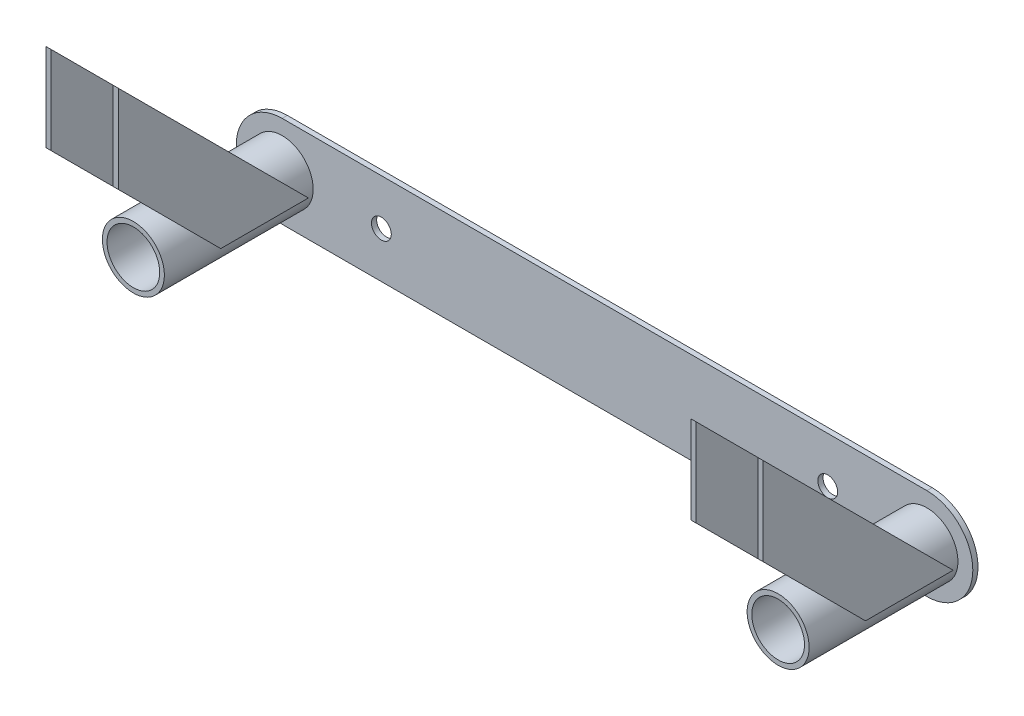
ISO-10303-21;
HEADER;
FILE_DESCRIPTION(('STEP AP214'),'2;1');
FILE_NAME('part.step','',(''),(''),'','','');
FILE_SCHEMA(('AUTOMOTIVE_DESIGN { 1 0 10303 214 1 1 1 1 }'));
ENDSEC;
DATA;
#1=APPLICATION_CONTEXT('core data for automotive mechanical design processes');
#2=APPLICATION_PROTOCOL_DEFINITION('international standard','automotive_design',2000,#1);
#3=PRODUCT_CONTEXT('',#1,'mechanical');
#4=PRODUCT('Part','Part','',(#3));
#5=PRODUCT_RELATED_PRODUCT_CATEGORY('part','',(#4));
#6=PRODUCT_DEFINITION_FORMATION('','',#4);
#7=PRODUCT_DEFINITION_CONTEXT('part definition',#1,'design');
#8=PRODUCT_DEFINITION('design','',#6,#7);
#9=PRODUCT_DEFINITION_SHAPE('','',#8);
#10=(LENGTH_UNIT() NAMED_UNIT(*) SI_UNIT(.MILLI.,.METRE.));
#11=(NAMED_UNIT(*) PLANE_ANGLE_UNIT() SI_UNIT($,.RADIAN.));
#12=(NAMED_UNIT(*) SI_UNIT($,.STERADIAN.) SOLID_ANGLE_UNIT());
#13=UNCERTAINTY_MEASURE_WITH_UNIT(LENGTH_MEASURE(1.E-05),#10,'distance_accuracy_value','');
#14=(GEOMETRIC_REPRESENTATION_CONTEXT(3) GLOBAL_UNCERTAINTY_ASSIGNED_CONTEXT((#13)) GLOBAL_UNIT_ASSIGNED_CONTEXT((#10,
#11,#12)) REPRESENTATION_CONTEXT('',''));
#15=CARTESIAN_POINT('',(0.,0.,0.));
#16=DIRECTION('',(0.,0.,1.));
#17=DIRECTION('',(1.,0.,0.));
#18=AXIS2_PLACEMENT_3D('',#15,#16,#17);
#19=CARTESIAN_POINT('',(183.6293,97.3387193946547,102.418719394654));
#20=DIRECTION('',(0.,-0.707106781186546,0.707106781186549));
#21=DIRECTION('',(0.,-0.707106781186549,-0.707106781186546));
#22=AXIS2_PLACEMENT_3D('',#19,#20,#21);
#23=PLANE('',#22);
#24=DIRECTION('',(0.,-0.707106781186549,-0.707106781186546));
#25=VECTOR('',#24,1.);
#26=CARTESIAN_POINT('',(180.975,97.3387193946547,102.418719394654));
#27=LINE('',#26,#25);
#28=CARTESIAN_POINT('',(180.975,97.3387193946547,102.418719394654));
#29=VERTEX_POINT('',#28);
#30=CARTESIAN_POINT('',(180.975,0.,5.08));
#31=VERTEX_POINT('',#30);
#32=EDGE_CURVE('E120',#29,#31,#27,.T.);
#33=ORIENTED_EDGE('',*,*,#32,.F.);
#34=DIRECTION('',(-1.,0.,0.));
#35=VECTOR('',#34,1.);
#36=CARTESIAN_POINT('',(183.6293,97.3387193946547,102.418719394654));
#37=LINE('',#36,#35);
#38=CARTESIAN_POINT('',(183.6293,97.3387193946547,102.418719394654));
#39=VERTEX_POINT('',#38);
#40=EDGE_CURVE('E119',#39,#29,#37,.T.);
#41=ORIENTED_EDGE('',*,*,#40,.F.);
#42=DIRECTION('',(0.,-0.707106781186549,-0.707106781186546));
#43=VECTOR('',#42,1.);
#44=CARTESIAN_POINT('',(183.6293,97.3387193946547,102.418719394654));
#45=LINE('',#44,#43);
#46=CARTESIAN_POINT('',(183.6293,0.,5.08));
#47=VERTEX_POINT('',#46);
#48=EDGE_CURVE('E112',#39,#47,#45,.T.);
#49=ORIENTED_EDGE('',*,*,#48,.T.);
#50=DIRECTION('',(-1.,0.,0.));
#51=VECTOR('',#50,1.);
#52=CARTESIAN_POINT('',(183.6293,0.,5.08));
#53=LINE('',#52,#51);
#54=EDGE_CURVE('E12',#47,#31,#53,.T.);
#55=ORIENTED_EDGE('',*,*,#54,.T.);
#56=EDGE_LOOP('',(#33,#41,#49,#55));
#57=FACE_BOUND('',#56,.T.);
#58=ADVANCED_FACE('F50',(#57),#23,.F.);
#59=CARTESIAN_POINT('',(183.6293,0.,5.08));
#60=DIRECTION('',(0.,1.,0.));
#61=DIRECTION('',(0.,0.,1.));
#62=AXIS2_PLACEMENT_3D('',#59,#60,#61);
#63=PLANE('',#62);
#64=DIRECTION('',(0.,0.,1.));
#65=VECTOR('',#64,1.);
#66=CARTESIAN_POINT('',(180.975,0.,5.08));
#67=LINE('',#66,#65);
#68=CARTESIAN_POINT('',(180.975,0.,49.9812806053457));
#69=VERTEX_POINT('',#68);
#70=EDGE_CURVE('E123',#31,#69,#67,.T.);
#71=ORIENTED_EDGE('',*,*,#70,.F.);
#72=ORIENTED_EDGE('',*,*,#54,.F.);
#73=DIRECTION('',(0.,0.,1.));
#74=VECTOR('',#73,1.);
#75=CARTESIAN_POINT('',(183.6293,0.,5.08));
#76=LINE('',#75,#74);
#77=CARTESIAN_POINT('',(183.6293,0.,49.9812806053457));
#78=VERTEX_POINT('',#77);
#79=EDGE_CURVE('E95',#47,#78,#76,.T.);
#80=ORIENTED_EDGE('',*,*,#79,.T.);
#81=DIRECTION('',(-1.,0.,0.));
#82=VECTOR('',#81,1.);
#83=CARTESIAN_POINT('',(183.6293,0.,49.9812806053457));
#84=LINE('',#83,#82);
#85=EDGE_CURVE('E58',#78,#69,#84,.T.);
#86=ORIENTED_EDGE('',*,*,#85,.T.);
#87=EDGE_LOOP('',(#71,#72,#80,#86));
#88=FACE_BOUND('',#87,.T.);
#89=ADVANCED_FACE('F110',(#88),#63,.F.);
#90=CARTESIAN_POINT('',(183.6293,0.,49.9812806053457));
#91=DIRECTION('',(0.,0.707106781186546,-0.707106781186549));
#92=DIRECTION('',(0.,0.707106781186549,0.707106781186546));
#93=AXIS2_PLACEMENT_3D('',#90,#91,#92);
#94=PLANE('',#93);
#95=DIRECTION('',(0.,0.707106781186549,0.707106781186546));
#96=VECTOR('',#95,1.);
#97=CARTESIAN_POINT('',(180.975,0.,49.9812806053457));
#98=LINE('',#97,#96);
#99=CARTESIAN_POINT('',(180.975,52.4374387893088,102.418719394654));
#100=VERTEX_POINT('',#99);
#101=EDGE_CURVE('E106',#69,#100,#98,.T.);
#102=ORIENTED_EDGE('',*,*,#101,.F.);
#103=ORIENTED_EDGE('',*,*,#85,.F.);
#104=DIRECTION('',(0.,0.707106781186549,0.707106781186546));
#105=VECTOR('',#104,1.);
#106=CARTESIAN_POINT('',(183.6293,0.,49.9812806053457));
#107=LINE('',#106,#105);
#108=CARTESIAN_POINT('',(183.6293,52.4374387893088,102.418719394654));
#109=VERTEX_POINT('',#108);
#110=EDGE_CURVE('E98',#78,#109,#107,.T.);
#111=ORIENTED_EDGE('',*,*,#110,.T.);
#112=DIRECTION('',(-1.,0.,0.));
#113=VECTOR('',#112,1.);
#114=CARTESIAN_POINT('',(183.6293,52.4374387893088,102.418719394654));
#115=LINE('',#114,#113);
#116=EDGE_CURVE('E109',#109,#100,#115,.T.);
#117=ORIENTED_EDGE('',*,*,#116,.T.);
#118=EDGE_LOOP('',(#102,#103,#111,#117));
#119=FACE_BOUND('',#118,.T.);
#120=ADVANCED_FACE('F105',(#119),#94,.F.);
#121=CARTESIAN_POINT('',(183.6293,52.4374387893088,102.418719394654));
#122=DIRECTION('',(0.,0.,-1.));
#123=DIRECTION('',(0.,1.,0.));
#124=AXIS2_PLACEMENT_3D('',#121,#122,#123);
#125=PLANE('',#124);
#126=DIRECTION('',(0.,1.,0.));
#127=VECTOR('',#126,1.);
#128=CARTESIAN_POINT('',(180.975,52.4374387893088,102.418719394654));
#129=LINE('',#128,#127);
#130=EDGE_CURVE('E84',#100,#29,#129,.T.);
#131=ORIENTED_EDGE('',*,*,#130,.F.);
#132=ORIENTED_EDGE('',*,*,#116,.F.);
#133=DIRECTION('',(0.,1.,0.));
#134=VECTOR('',#133,1.);
#135=CARTESIAN_POINT('',(183.6293,52.4374387893088,102.418719394654));
#136=LINE('',#135,#134);
#137=EDGE_CURVE('E69',#109,#39,#136,.T.);
#138=ORIENTED_EDGE('',*,*,#137,.T.);
#139=ORIENTED_EDGE('',*,*,#40,.T.);
#140=EDGE_LOOP('',(#131,#132,#138,#139));
#141=FACE_BOUND('',#140,.T.);
#142=ADVANCED_FACE('F136',(#141),#125,.F.);
#143=CARTESIAN_POINT('',(183.6293,0.,5.08000000000002));
#144=DIRECTION('',(1.,0.,0.));
#145=DIRECTION('',(0.,0.,1.));
#146=AXIS2_PLACEMENT_3D('',#143,#144,#145);
#147=PLANE('',#146);
#148=ORIENTED_EDGE('',*,*,#48,.F.);
#149=ORIENTED_EDGE('',*,*,#137,.F.);
#150=ORIENTED_EDGE('',*,*,#110,.F.);
#151=ORIENTED_EDGE('',*,*,#79,.F.);
#152=EDGE_LOOP('',(#148,#149,#150,#151));
#153=FACE_BOUND('',#152,.T.);
#154=ADVANCED_FACE('F100',(#153),#147,.T.);
#155=CARTESIAN_POINT('',(180.975,0.,5.08000000000002));
#156=DIRECTION('',(1.,0.,0.));
#157=DIRECTION('',(0.,0.,1.));
#158=AXIS2_PLACEMENT_3D('',#155,#156,#157);
#159=PLANE('',#158);
#160=ORIENTED_EDGE('',*,*,#32,.T.);
#161=ORIENTED_EDGE('',*,*,#70,.T.);
#162=ORIENTED_EDGE('',*,*,#101,.T.);
#163=ORIENTED_EDGE('',*,*,#130,.T.);
#164=EDGE_LOOP('',(#160,#161,#162,#163));
#165=FACE_BOUND('',#164,.T.);
#166=ADVANCED_FACE('F132',(#165),#159,.F.);
#167=CLOSED_SHELL('',(#58,#89,#120,#142,#154,#166));
#168=MANIFOLD_SOLID_BREP('B2',#167);
#169=CARTESIAN_POINT('',(146.5707,97.3387193946547,102.418719394654));
#170=DIRECTION('',(0.,-0.707106781186546,0.707106781186549));
#171=DIRECTION('',(0.,-0.707106781186549,-0.707106781186546));
#172=AXIS2_PLACEMENT_3D('',#169,#170,#171);
#173=PLANE('',#172);
#174=DIRECTION('',(0.,-0.707106781186549,-0.707106781186546));
#175=VECTOR('',#174,1.);
#176=CARTESIAN_POINT('',(149.225,97.3387193946547,102.418719394654));
#177=LINE('',#176,#175);
#178=CARTESIAN_POINT('',(149.225,97.3387193946547,102.418719394654));
#179=VERTEX_POINT('',#178);
#180=CARTESIAN_POINT('',(149.225,0.,5.08));
#181=VERTEX_POINT('',#180);
#182=EDGE_CURVE('E275',#179,#181,#177,.T.);
#183=ORIENTED_EDGE('',*,*,#182,.T.);
#184=DIRECTION('',(1.,0.,0.));
#185=VECTOR('',#184,1.);
#186=CARTESIAN_POINT('',(146.5707,0.,5.08));
#187=LINE('',#186,#185);
#188=CARTESIAN_POINT('',(146.5707,0.,5.08));
#189=VERTEX_POINT('',#188);
#190=EDGE_CURVE('E48',#189,#181,#187,.T.);
#191=ORIENTED_EDGE('',*,*,#190,.F.);
#192=DIRECTION('',(0.,-0.707106781186549,-0.707106781186546));
#193=VECTOR('',#192,1.);
#194=CARTESIAN_POINT('',(146.5707,97.3387193946547,102.418719394654));
#195=LINE('',#194,#193);
#196=CARTESIAN_POINT('',(146.5707,97.3387193946547,102.418719394654));
#197=VERTEX_POINT('',#196);
#198=EDGE_CURVE('E258',#197,#189,#195,.T.);
#199=ORIENTED_EDGE('',*,*,#198,.F.);
#200=DIRECTION('',(1.,0.,0.));
#201=VECTOR('',#200,1.);
#202=CARTESIAN_POINT('',(146.5707,97.3387193946547,102.418719394654));
#203=LINE('',#202,#201);
#204=EDGE_CURVE('E264',#197,#179,#203,.T.);
#205=ORIENTED_EDGE('',*,*,#204,.T.);
#206=EDGE_LOOP('',(#183,#191,#199,#205));
#207=FACE_BOUND('',#206,.T.);
#208=ADVANCED_FACE('F198',(#207),#173,.F.);
#209=CARTESIAN_POINT('',(146.5707,0.,5.08));
#210=DIRECTION('',(0.,1.,0.));
#211=DIRECTION('',(0.,0.,1.));
#212=AXIS2_PLACEMENT_3D('',#209,#210,#211);
#213=PLANE('',#212);
#214=DIRECTION('',(0.,0.,1.));
#215=VECTOR('',#214,1.);
#216=CARTESIAN_POINT('',(149.225,0.,5.08));
#217=LINE('',#216,#215);
#218=CARTESIAN_POINT('',(149.225,0.,49.9812806053457));
#219=VERTEX_POINT('',#218);
#220=EDGE_CURVE('E262',#181,#219,#217,.T.);
#221=ORIENTED_EDGE('',*,*,#220,.T.);
#222=DIRECTION('',(1.,0.,0.));
#223=VECTOR('',#222,1.);
#224=CARTESIAN_POINT('',(146.5707,0.,49.9812806053457));
#225=LINE('',#224,#223);
#226=CARTESIAN_POINT('',(146.5707,0.,49.9812806053457));
#227=VERTEX_POINT('',#226);
#228=EDGE_CURVE('E206',#227,#219,#225,.T.);
#229=ORIENTED_EDGE('',*,*,#228,.F.);
#230=DIRECTION('',(0.,0.,1.));
#231=VECTOR('',#230,1.);
#232=CARTESIAN_POINT('',(146.5707,0.,5.08));
#233=LINE('',#232,#231);
#234=EDGE_CURVE('E244',#189,#227,#233,.T.);
#235=ORIENTED_EDGE('',*,*,#234,.F.);
#236=ORIENTED_EDGE('',*,*,#190,.T.);
#237=EDGE_LOOP('',(#221,#229,#235,#236));
#238=FACE_BOUND('',#237,.T.);
#239=ADVANCED_FACE('F261',(#238),#213,.F.);
#240=CARTESIAN_POINT('',(146.5707,0.,49.9812806053457));
#241=DIRECTION('',(0.,0.707106781186546,-0.707106781186549));
#242=DIRECTION('',(0.,0.707106781186549,0.707106781186546));
#243=AXIS2_PLACEMENT_3D('',#240,#241,#242);
#244=PLANE('',#243);
#245=DIRECTION('',(0.,0.707106781186549,0.707106781186546));
#246=VECTOR('',#245,1.);
#247=CARTESIAN_POINT('',(149.225,0.,49.9812806053457));
#248=LINE('',#247,#246);
#249=CARTESIAN_POINT('',(149.225,52.4374387893088,102.418719394654));
#250=VERTEX_POINT('',#249);
#251=EDGE_CURVE('E271',#219,#250,#248,.T.);
#252=ORIENTED_EDGE('',*,*,#251,.T.);
#253=DIRECTION('',(1.,0.,0.));
#254=VECTOR('',#253,1.);
#255=CARTESIAN_POINT('',(146.5707,52.4374387893088,102.418719394654));
#256=LINE('',#255,#254);
#257=CARTESIAN_POINT('',(146.5707,52.4374387893088,102.418719394654));
#258=VERTEX_POINT('',#257);
#259=EDGE_CURVE('E253',#258,#250,#256,.T.);
#260=ORIENTED_EDGE('',*,*,#259,.F.);
#261=DIRECTION('',(0.,0.707106781186549,0.707106781186546));
#262=VECTOR('',#261,1.);
#263=CARTESIAN_POINT('',(146.5707,0.,49.9812806053457));
#264=LINE('',#263,#262);
#265=EDGE_CURVE('E249',#227,#258,#264,.T.);
#266=ORIENTED_EDGE('',*,*,#265,.F.);
#267=ORIENTED_EDGE('',*,*,#228,.T.);
#268=EDGE_LOOP('',(#252,#260,#266,#267));
#269=FACE_BOUND('',#268,.T.);
#270=ADVANCED_FACE('F251',(#269),#244,.F.);
#271=CARTESIAN_POINT('',(146.5707,52.4374387893088,102.418719394654));
#272=DIRECTION('',(0.,0.,-1.));
#273=DIRECTION('',(0.,1.,0.));
#274=AXIS2_PLACEMENT_3D('',#271,#272,#273);
#275=PLANE('',#274);
#276=DIRECTION('',(0.,1.,0.));
#277=VECTOR('',#276,1.);
#278=CARTESIAN_POINT('',(149.225,52.4374387893088,102.418719394654));
#279=LINE('',#278,#277);
#280=EDGE_CURVE('E234',#250,#179,#279,.T.);
#281=ORIENTED_EDGE('',*,*,#280,.T.);
#282=ORIENTED_EDGE('',*,*,#204,.F.);
#283=DIRECTION('',(0.,1.,0.));
#284=VECTOR('',#283,1.);
#285=CARTESIAN_POINT('',(146.5707,52.4374387893088,102.418719394654));
#286=LINE('',#285,#284);
#287=EDGE_CURVE('E216',#258,#197,#286,.T.);
#288=ORIENTED_EDGE('',*,*,#287,.F.);
#289=ORIENTED_EDGE('',*,*,#259,.T.);
#290=EDGE_LOOP('',(#281,#282,#288,#289));
#291=FACE_BOUND('',#290,.T.);
#292=ADVANCED_FACE('F289',(#291),#275,.F.);
#293=CARTESIAN_POINT('',(146.5707,0.,5.08000000000002));
#294=DIRECTION('',(-1.,0.,0.));
#295=DIRECTION('',(0.,0.,1.));
#296=AXIS2_PLACEMENT_3D('',#293,#294,#295);
#297=PLANE('',#296);
#298=ORIENTED_EDGE('',*,*,#198,.T.);
#299=ORIENTED_EDGE('',*,*,#234,.T.);
#300=ORIENTED_EDGE('',*,*,#265,.T.);
#301=ORIENTED_EDGE('',*,*,#287,.T.);
#302=EDGE_LOOP('',(#298,#299,#300,#301));
#303=FACE_BOUND('',#302,.T.);
#304=ADVANCED_FACE('F256',(#303),#297,.T.);
#305=CARTESIAN_POINT('',(149.225,0.,5.08000000000002));
#306=DIRECTION('',(-1.,0.,0.));
#307=DIRECTION('',(0.,0.,1.));
#308=AXIS2_PLACEMENT_3D('',#305,#306,#307);
#309=PLANE('',#308);
#310=ORIENTED_EDGE('',*,*,#182,.F.);
#311=ORIENTED_EDGE('',*,*,#280,.F.);
#312=ORIENTED_EDGE('',*,*,#251,.F.);
#313=ORIENTED_EDGE('',*,*,#220,.F.);
#314=EDGE_LOOP('',(#310,#311,#312,#313));
#315=FACE_BOUND('',#314,.T.);
#316=ADVANCED_FACE('F283',(#315),#309,.F.);
#317=CLOSED_SHELL('',(#208,#239,#270,#292,#304,#316));
#318=MANIFOLD_SOLID_BREP('B6',#317);
#319=CARTESIAN_POINT('',(-146.5707,97.3387193946547,102.418719394654));
#320=DIRECTION('',(0.,-0.707106781186546,0.707106781186549));
#321=DIRECTION('',(0.,-0.707106781186549,-0.707106781186546));
#322=AXIS2_PLACEMENT_3D('',#319,#320,#321);
#323=PLANE('',#322);
#324=DIRECTION('',(0.,-0.707106781186549,-0.707106781186546));
#325=VECTOR('',#324,1.);
#326=CARTESIAN_POINT('',(-149.225,97.3387193946547,102.418719394654));
#327=LINE('',#326,#325);
#328=CARTESIAN_POINT('',(-149.225,97.3387193946547,102.418719394654));
#329=VERTEX_POINT('',#328);
#330=CARTESIAN_POINT('',(-149.225,0.,5.08));
#331=VERTEX_POINT('',#330);
#332=EDGE_CURVE('E425',#329,#331,#327,.T.);
#333=ORIENTED_EDGE('',*,*,#332,.F.);
#334=DIRECTION('',(-1.,0.,0.));
#335=VECTOR('',#334,1.);
#336=CARTESIAN_POINT('',(-146.5707,97.3387193946547,102.418719394654));
#337=LINE('',#336,#335);
#338=CARTESIAN_POINT('',(-146.5707,97.3387193946547,102.418719394654));
#339=VERTEX_POINT('',#338);
#340=EDGE_CURVE('E424',#339,#329,#337,.T.);
#341=ORIENTED_EDGE('',*,*,#340,.F.);
#342=DIRECTION('',(0.,-0.707106781186549,-0.707106781186546));
#343=VECTOR('',#342,1.);
#344=CARTESIAN_POINT('',(-146.5707,97.3387193946547,102.418719394654));
#345=LINE('',#344,#343);
#346=CARTESIAN_POINT('',(-146.5707,0.,5.08));
#347=VERTEX_POINT('',#346);
#348=EDGE_CURVE('E415',#339,#347,#345,.T.);
#349=ORIENTED_EDGE('',*,*,#348,.T.);
#350=DIRECTION('',(-1.,0.,0.));
#351=VECTOR('',#350,1.);
#352=CARTESIAN_POINT('',(-146.5707,0.,5.08));
#353=LINE('',#352,#351);
#354=EDGE_CURVE('E196',#347,#331,#353,.T.);
#355=ORIENTED_EDGE('',*,*,#354,.T.);
#356=EDGE_LOOP('',(#333,#341,#349,#355));
#357=FACE_BOUND('',#356,.T.);
#358=ADVANCED_FACE('F346',(#357),#323,.F.);
#359=CARTESIAN_POINT('',(-146.5707,0.,5.08));
#360=DIRECTION('',(0.,1.,0.));
#361=DIRECTION('',(0.,0.,1.));
#362=AXIS2_PLACEMENT_3D('',#359,#360,#361);
#363=PLANE('',#362);
#364=DIRECTION('',(0.,0.,1.));
#365=VECTOR('',#364,1.);
#366=CARTESIAN_POINT('',(-149.225,0.,5.08));
#367=LINE('',#366,#365);
#368=CARTESIAN_POINT('',(-149.225,0.,49.9812806053457));
#369=VERTEX_POINT('',#368);
#370=EDGE_CURVE('E428',#331,#369,#367,.T.);
#371=ORIENTED_EDGE('',*,*,#370,.F.);
#372=ORIENTED_EDGE('',*,*,#354,.F.);
#373=DIRECTION('',(0.,0.,1.));
#374=VECTOR('',#373,1.);
#375=CARTESIAN_POINT('',(-146.5707,0.,5.08));
#376=LINE('',#375,#374);
#377=CARTESIAN_POINT('',(-146.5707,0.,49.9812806053457));
#378=VERTEX_POINT('',#377);
#379=EDGE_CURVE('E396',#347,#378,#376,.T.);
#380=ORIENTED_EDGE('',*,*,#379,.T.);
#381=DIRECTION('',(-1.,0.,0.));
#382=VECTOR('',#381,1.);
#383=CARTESIAN_POINT('',(-146.5707,0.,49.9812806053457));
#384=LINE('',#383,#382);
#385=EDGE_CURVE('E355',#378,#369,#384,.T.);
#386=ORIENTED_EDGE('',*,*,#385,.T.);
#387=EDGE_LOOP('',(#371,#372,#380,#386));
#388=FACE_BOUND('',#387,.T.);
#389=ADVANCED_FACE('F412',(#388),#363,.F.);
#390=CARTESIAN_POINT('',(-146.5707,0.,49.9812806053457));
#391=DIRECTION('',(0.,0.707106781186546,-0.707106781186549));
#392=DIRECTION('',(0.,0.707106781186549,0.707106781186546));
#393=AXIS2_PLACEMENT_3D('',#390,#391,#392);
#394=PLANE('',#393);
#395=DIRECTION('',(0.,0.707106781186549,0.707106781186546));
#396=VECTOR('',#395,1.);
#397=CARTESIAN_POINT('',(-149.225,0.,49.9812806053457));
#398=LINE('',#397,#396);
#399=CARTESIAN_POINT('',(-149.225,52.4374387893088,102.418719394654));
#400=VERTEX_POINT('',#399);
#401=EDGE_CURVE('E407',#369,#400,#398,.T.);
#402=ORIENTED_EDGE('',*,*,#401,.F.);
#403=ORIENTED_EDGE('',*,*,#385,.F.);
#404=DIRECTION('',(0.,0.707106781186549,0.707106781186546));
#405=VECTOR('',#404,1.);
#406=CARTESIAN_POINT('',(-146.5707,0.,49.9812806053457));
#407=LINE('',#406,#405);
#408=CARTESIAN_POINT('',(-146.5707,52.4374387893088,102.418719394654));
#409=VERTEX_POINT('',#408);
#410=EDGE_CURVE('E399',#378,#409,#407,.T.);
#411=ORIENTED_EDGE('',*,*,#410,.T.);
#412=DIRECTION('',(-1.,0.,0.));
#413=VECTOR('',#412,1.);
#414=CARTESIAN_POINT('',(-146.5707,52.4374387893088,102.418719394654));
#415=LINE('',#414,#413);
#416=EDGE_CURVE('E411',#409,#400,#415,.T.);
#417=ORIENTED_EDGE('',*,*,#416,.T.);
#418=EDGE_LOOP('',(#402,#403,#411,#417));
#419=FACE_BOUND('',#418,.T.);
#420=ADVANCED_FACE('F406',(#419),#394,.F.);
#421=CARTESIAN_POINT('',(-146.5707,52.4374387893088,102.418719394654));
#422=DIRECTION('',(0.,0.,-1.));
#423=DIRECTION('',(0.,1.,0.));
#424=AXIS2_PLACEMENT_3D('',#421,#422,#423);
#425=PLANE('',#424);
#426=DIRECTION('',(0.,1.,0.));
#427=VECTOR('',#426,1.);
#428=CARTESIAN_POINT('',(-149.225,52.4374387893088,102.418719394654));
#429=LINE('',#428,#427);
#430=EDGE_CURVE('E383',#400,#329,#429,.T.);
#431=ORIENTED_EDGE('',*,*,#430,.F.);
#432=ORIENTED_EDGE('',*,*,#416,.F.);
#433=DIRECTION('',(0.,1.,0.));
#434=VECTOR('',#433,1.);
#435=CARTESIAN_POINT('',(-146.5707,52.4374387893088,102.418719394654));
#436=LINE('',#435,#434);
#437=EDGE_CURVE('E366',#409,#339,#436,.T.);
#438=ORIENTED_EDGE('',*,*,#437,.T.);
#439=ORIENTED_EDGE('',*,*,#340,.T.);
#440=EDGE_LOOP('',(#431,#432,#438,#439));
#441=FACE_BOUND('',#440,.T.);
#442=ADVANCED_FACE('F440',(#441),#425,.F.);
#443=CARTESIAN_POINT('',(-146.5707,0.,5.08000000000002));
#444=DIRECTION('',(1.,0.,0.));
#445=DIRECTION('',(0.,0.,1.));
#446=AXIS2_PLACEMENT_3D('',#443,#444,#445);
#447=PLANE('',#446);
#448=ORIENTED_EDGE('',*,*,#348,.F.);
#449=ORIENTED_EDGE('',*,*,#437,.F.);
#450=ORIENTED_EDGE('',*,*,#410,.F.);
#451=ORIENTED_EDGE('',*,*,#379,.F.);
#452=EDGE_LOOP('',(#448,#449,#450,#451));
#453=FACE_BOUND('',#452,.T.);
#454=ADVANCED_FACE('F401',(#453),#447,.T.);
#455=CARTESIAN_POINT('',(-149.225,0.,5.08000000000002));
#456=DIRECTION('',(1.,0.,0.));
#457=DIRECTION('',(0.,0.,1.));
#458=AXIS2_PLACEMENT_3D('',#455,#456,#457);
#459=PLANE('',#458);
#460=ORIENTED_EDGE('',*,*,#332,.T.);
#461=ORIENTED_EDGE('',*,*,#370,.T.);
#462=ORIENTED_EDGE('',*,*,#401,.T.);
#463=ORIENTED_EDGE('',*,*,#430,.T.);
#464=EDGE_LOOP('',(#460,#461,#462,#463));
#465=FACE_BOUND('',#464,.T.);
#466=ADVANCED_FACE('F436',(#465),#459,.F.);
#467=CLOSED_SHELL('',(#358,#389,#420,#442,#454,#466));
#468=MANIFOLD_SOLID_BREP('B42',#467);
#469=CARTESIAN_POINT('',(-183.6293,97.3387193946547,102.418719394654));
#470=DIRECTION('',(0.,-0.707106781186546,0.707106781186549));
#471=DIRECTION('',(0.,-0.707106781186549,-0.707106781186546));
#472=AXIS2_PLACEMENT_3D('',#469,#470,#471);
#473=PLANE('',#472);
#474=DIRECTION('',(0.,-0.707106781186549,-0.707106781186546));
#475=VECTOR('',#474,1.);
#476=CARTESIAN_POINT('',(-180.975,97.3387193946547,102.418719394654));
#477=LINE('',#476,#475);
#478=CARTESIAN_POINT('',(-180.975,97.3387193946547,102.418719394654));
#479=VERTEX_POINT('',#478);
#480=CARTESIAN_POINT('',(-180.975,0.,5.08));
#481=VERTEX_POINT('',#480);
#482=EDGE_CURVE('E579',#479,#481,#477,.T.);
#483=ORIENTED_EDGE('',*,*,#482,.T.);
#484=DIRECTION('',(1.,0.,0.));
#485=VECTOR('',#484,1.);
#486=CARTESIAN_POINT('',(-183.6293,0.,5.08));
#487=LINE('',#486,#485);
#488=CARTESIAN_POINT('',(-183.6293,0.,5.08));
#489=VERTEX_POINT('',#488);
#490=EDGE_CURVE('E344',#489,#481,#487,.T.);
#491=ORIENTED_EDGE('',*,*,#490,.F.);
#492=DIRECTION('',(0.,-0.707106781186549,-0.707106781186546));
#493=VECTOR('',#492,1.);
#494=CARTESIAN_POINT('',(-183.6293,97.3387193946547,102.418719394654));
#495=LINE('',#494,#493);
#496=CARTESIAN_POINT('',(-183.6293,97.3387193946547,102.418719394654));
#497=VERTEX_POINT('',#496);
#498=EDGE_CURVE('E562',#497,#489,#495,.T.);
#499=ORIENTED_EDGE('',*,*,#498,.F.);
#500=DIRECTION('',(1.,0.,0.));
#501=VECTOR('',#500,1.);
#502=CARTESIAN_POINT('',(-183.6293,97.3387193946547,102.418719394654));
#503=LINE('',#502,#501);
#504=EDGE_CURVE('E575',#497,#479,#503,.T.);
#505=ORIENTED_EDGE('',*,*,#504,.T.);
#506=EDGE_LOOP('',(#483,#491,#499,#505));
#507=FACE_BOUND('',#506,.T.);
#508=ADVANCED_FACE('F502',(#507),#473,.F.);
#509=CARTESIAN_POINT('',(-183.6293,0.,5.08));
#510=DIRECTION('',(0.,1.,0.));
#511=DIRECTION('',(0.,0.,1.));
#512=AXIS2_PLACEMENT_3D('',#509,#510,#511);
#513=PLANE('',#512);
#514=DIRECTION('',(0.,0.,1.));
#515=VECTOR('',#514,1.);
#516=CARTESIAN_POINT('',(-180.975,0.,5.08));
#517=LINE('',#516,#515);
#518=CARTESIAN_POINT('',(-180.975,0.,49.9812806053457));
#519=VERTEX_POINT('',#518);
#520=EDGE_CURVE('E567',#481,#519,#517,.T.);
#521=ORIENTED_EDGE('',*,*,#520,.T.);
#522=DIRECTION('',(1.,0.,0.));
#523=VECTOR('',#522,1.);
#524=CARTESIAN_POINT('',(-183.6293,0.,49.9812806053457));
#525=LINE('',#524,#523);
#526=CARTESIAN_POINT('',(-183.6293,0.,49.9812806053457));
#527=VERTEX_POINT('',#526);
#528=EDGE_CURVE('E511',#527,#519,#525,.T.);
#529=ORIENTED_EDGE('',*,*,#528,.F.);
#530=DIRECTION('',(0.,0.,1.));
#531=VECTOR('',#530,1.);
#532=CARTESIAN_POINT('',(-183.6293,0.,5.08));
#533=LINE('',#532,#531);
#534=EDGE_CURVE('E556',#489,#527,#533,.T.);
#535=ORIENTED_EDGE('',*,*,#534,.F.);
#536=ORIENTED_EDGE('',*,*,#490,.T.);
#537=EDGE_LOOP('',(#521,#529,#535,#536));
#538=FACE_BOUND('',#537,.T.);
#539=ADVANCED_FACE('F566',(#538),#513,.F.);
#540=CARTESIAN_POINT('',(-183.6293,0.,49.9812806053457));
#541=DIRECTION('',(0.,0.707106781186546,-0.707106781186549));
#542=DIRECTION('',(0.,0.707106781186549,0.707106781186546));
#543=AXIS2_PLACEMENT_3D('',#540,#541,#542);
#544=PLANE('',#543);
#545=DIRECTION('',(0.,0.707106781186549,0.707106781186546));
#546=VECTOR('',#545,1.);
#547=CARTESIAN_POINT('',(-180.975,0.,49.9812806053457));
#548=LINE('',#547,#546);
#549=CARTESIAN_POINT('',(-180.975,52.4374387893088,102.418719394654));
#550=VERTEX_POINT('',#549);
#551=EDGE_CURVE('E542',#519,#550,#548,.T.);
#552=ORIENTED_EDGE('',*,*,#551,.T.);
#553=DIRECTION('',(1.,0.,0.));
#554=VECTOR('',#553,1.);
#555=CARTESIAN_POINT('',(-183.6293,52.4374387893088,102.418719394654));
#556=LINE('',#555,#554);
#557=CARTESIAN_POINT('',(-183.6293,52.4374387893088,102.418719394654));
#558=VERTEX_POINT('',#557);
#559=EDGE_CURVE('E569',#558,#550,#556,.T.);
#560=ORIENTED_EDGE('',*,*,#559,.F.);
#561=DIRECTION('',(0.,0.707106781186549,0.707106781186546));
#562=VECTOR('',#561,1.);
#563=CARTESIAN_POINT('',(-183.6293,0.,49.9812806053457));
#564=LINE('',#563,#562);
#565=EDGE_CURVE('E560',#527,#558,#564,.T.);
#566=ORIENTED_EDGE('',*,*,#565,.F.);
#567=ORIENTED_EDGE('',*,*,#528,.T.);
#568=EDGE_LOOP('',(#552,#560,#566,#567));
#569=FACE_BOUND('',#568,.T.);
#570=ADVANCED_FACE('F570',(#569),#544,.F.);
#571=CARTESIAN_POINT('',(-183.6293,52.4374387893088,102.418719394654));
#572=DIRECTION('',(0.,0.,-1.));
#573=DIRECTION('',(0.,1.,0.));
#574=AXIS2_PLACEMENT_3D('',#571,#572,#573);
#575=PLANE('',#574);
#576=DIRECTION('',(0.,1.,0.));
#577=VECTOR('',#576,1.);
#578=CARTESIAN_POINT('',(-180.975,52.4374387893088,102.418719394654));
#579=LINE('',#578,#577);
#580=EDGE_CURVE('E548',#550,#479,#579,.T.);
#581=ORIENTED_EDGE('',*,*,#580,.T.);
#582=ORIENTED_EDGE('',*,*,#504,.F.);
#583=DIRECTION('',(0.,1.,0.));
#584=VECTOR('',#583,1.);
#585=CARTESIAN_POINT('',(-183.6293,52.4374387893088,102.418719394654));
#586=LINE('',#585,#584);
#587=EDGE_CURVE('E522',#558,#497,#586,.T.);
#588=ORIENTED_EDGE('',*,*,#587,.F.);
#589=ORIENTED_EDGE('',*,*,#559,.T.);
#590=EDGE_LOOP('',(#581,#582,#588,#589));
#591=FACE_BOUND('',#590,.T.);
#592=ADVANCED_FACE('F591',(#591),#575,.F.);
#593=CARTESIAN_POINT('',(-183.6293,0.,5.08000000000002));
#594=DIRECTION('',(-1.,0.,0.));
#595=DIRECTION('',(0.,0.,1.));
#596=AXIS2_PLACEMENT_3D('',#593,#594,#595);
#597=PLANE('',#596);
#598=ORIENTED_EDGE('',*,*,#498,.T.);
#599=ORIENTED_EDGE('',*,*,#534,.T.);
#600=ORIENTED_EDGE('',*,*,#565,.T.);
#601=ORIENTED_EDGE('',*,*,#587,.T.);
#602=EDGE_LOOP('',(#598,#599,#600,#601));
#603=FACE_BOUND('',#602,.T.);
#604=ADVANCED_FACE('F558',(#603),#597,.T.);
#605=CARTESIAN_POINT('',(-180.975,0.,5.08000000000002));
#606=DIRECTION('',(-1.,0.,0.));
#607=DIRECTION('',(0.,0.,1.));
#608=AXIS2_PLACEMENT_3D('',#605,#606,#607);
#609=PLANE('',#608);
#610=ORIENTED_EDGE('',*,*,#482,.F.);
#611=ORIENTED_EDGE('',*,*,#580,.F.);
#612=ORIENTED_EDGE('',*,*,#551,.F.);
#613=ORIENTED_EDGE('',*,*,#520,.F.);
#614=EDGE_LOOP('',(#610,#611,#612,#613));
#615=FACE_BOUND('',#614,.T.);
#616=ADVANCED_FACE('F594',(#615),#609,.F.);
#617=CLOSED_SHELL('',(#508,#539,#570,#592,#604,#616));
#618=MANIFOLD_SOLID_BREP('B190',#617);
#619=CARTESIAN_POINT('',(0.,-295.794284526882,-2.6543));
#620=DIRECTION('',(0.,0.,1.));
#621=DIRECTION('',(1.,0.,0.));
#622=AXIS2_PLACEMENT_3D('',#619,#620,#621);
#623=PLANE('',#622);
#624=CARTESIAN_POINT('',(-114.3,0.,-2.6543));
#625=DIRECTION('',(0.,0.,1.));
#626=DIRECTION('',(1.,0.,0.));
#627=AXIS2_PLACEMENT_3D('',#624,#625,#626);
#628=CIRCLE('',#627,5.08);
#629=CARTESIAN_POINT('',(-109.22,0.,-2.6543));
#630=VERTEX_POINT('',#629);
#631=EDGE_CURVE('E742',#630,#630,#628,.T.);
#632=ORIENTED_EDGE('',*,*,#631,.T.);
#633=EDGE_LOOP('',(#632));
#634=FACE_BOUND('',#633,.T.);
#635=CARTESIAN_POINT('',(165.1,0.,-2.6543));
#636=DIRECTION('',(0.,0.,1.));
#637=DIRECTION('',(1.,0.,0.));
#638=AXIS2_PLACEMENT_3D('',#635,#636,#637);
#639=CIRCLE('',#638,23.495);
#640=CARTESIAN_POINT('',(165.1,23.4950000000001,-2.6543));
#641=VERTEX_POINT('',#640);
#642=CARTESIAN_POINT('',(165.1,-23.4949999999999,-2.6543));
#643=VERTEX_POINT('',#642);
#644=EDGE_CURVE('E676',#641,#643,#639,.F.);
#645=ORIENTED_EDGE('',*,*,#644,.T.);
#646=DIRECTION('',(1.,0.,0.));
#647=VECTOR('',#646,1.);
#648=CARTESIAN_POINT('',(0.,-23.4949999999999,-2.6543));
#649=LINE('',#648,#647);
#650=CARTESIAN_POINT('',(-165.1,-23.495,-2.6543));
#651=VERTEX_POINT('',#650);
#652=EDGE_CURVE('E721',#651,#643,#649,.T.);
#653=ORIENTED_EDGE('',*,*,#652,.F.);
#654=CARTESIAN_POINT('',(-165.1,0.,-2.6543));
#655=DIRECTION('',(0.,0.,1.));
#656=DIRECTION('',(1.,0.,0.));
#657=AXIS2_PLACEMENT_3D('',#654,#655,#656);
#658=CIRCLE('',#657,23.495);
#659=CARTESIAN_POINT('',(-165.1,23.495,-2.6543));
#660=VERTEX_POINT('',#659);
#661=EDGE_CURVE('E711',#660,#651,#658,.T.);
#662=ORIENTED_EDGE('',*,*,#661,.F.);
#663=DIRECTION('',(1.,0.,0.));
#664=VECTOR('',#663,1.);
#665=CARTESIAN_POINT('',(0.,23.495,-2.6543));
#666=LINE('',#665,#664);
#667=EDGE_CURVE('E705',#660,#641,#666,.T.);
#668=ORIENTED_EDGE('',*,*,#667,.T.);
#669=EDGE_LOOP('',(#645,#653,#662,#668));
#670=FACE_BOUND('',#669,.T.);
#671=CARTESIAN_POINT('',(114.3,0.,-2.6543));
#672=DIRECTION('',(0.,0.,1.));
#673=DIRECTION('',(1.,0.,0.));
#674=AXIS2_PLACEMENT_3D('',#671,#672,#673);
#675=CIRCLE('',#674,5.08);
#676=CARTESIAN_POINT('',(119.38,0.,-2.6543));
#677=VERTEX_POINT('',#676);
#678=EDGE_CURVE('E732',#677,#677,#675,.F.);
#679=ORIENTED_EDGE('',*,*,#678,.F.);
#680=EDGE_LOOP('',(#679));
#681=FACE_BOUND('',#680,.T.);
#682=ADVANCED_FACE('F657',(#634,#670,#681),#623,.F.);
#683=CARTESIAN_POINT('',(0.,-295.794284526882,0.));
#684=DIRECTION('',(0.,0.,1.));
#685=DIRECTION('',(1.,0.,0.));
#686=AXIS2_PLACEMENT_3D('',#683,#684,#685);
#687=PLANE('',#686);
#688=CARTESIAN_POINT('',(-114.3,0.,0.));
#689=DIRECTION('',(0.,0.,1.));
#690=DIRECTION('',(1.,0.,0.));
#691=AXIS2_PLACEMENT_3D('',#688,#689,#690);
#692=CIRCLE('',#691,5.08);
#693=CARTESIAN_POINT('',(-109.22,0.,0.));
#694=VERTEX_POINT('',#693);
#695=EDGE_CURVE('E745',#694,#694,#692,.T.);
#696=ORIENTED_EDGE('',*,*,#695,.F.);
#697=EDGE_LOOP('',(#696));
#698=FACE_BOUND('',#697,.T.);
#699=CARTESIAN_POINT('',(165.1,0.,0.));
#700=DIRECTION('',(0.,0.,1.));
#701=DIRECTION('',(1.,0.,0.));
#702=AXIS2_PLACEMENT_3D('',#699,#700,#701);
#703=CIRCLE('',#702,23.495);
#704=CARTESIAN_POINT('',(165.1,23.4950000000001,0.));
#705=VERTEX_POINT('',#704);
#706=CARTESIAN_POINT('',(165.1,-23.4949999999999,0.));
#707=VERTEX_POINT('',#706);
#708=EDGE_CURVE('E729',#705,#707,#703,.F.);
#709=ORIENTED_EDGE('',*,*,#708,.F.);
#710=DIRECTION('',(1.,0.,0.));
#711=VECTOR('',#710,1.);
#712=CARTESIAN_POINT('',(0.,23.495,0.));
#713=LINE('',#712,#711);
#714=CARTESIAN_POINT('',(-165.1,23.495,0.));
#715=VERTEX_POINT('',#714);
#716=EDGE_CURVE('E731',#715,#705,#713,.T.);
#717=ORIENTED_EDGE('',*,*,#716,.F.);
#718=CARTESIAN_POINT('',(-165.1,0.,0.));
#719=DIRECTION('',(0.,0.,1.));
#720=DIRECTION('',(1.,0.,0.));
#721=AXIS2_PLACEMENT_3D('',#718,#719,#720);
#722=CIRCLE('',#721,23.495);
#723=CARTESIAN_POINT('',(-165.1,-23.495,0.));
#724=VERTEX_POINT('',#723);
#725=EDGE_CURVE('E712',#715,#724,#722,.T.);
#726=ORIENTED_EDGE('',*,*,#725,.T.);
#727=DIRECTION('',(1.,0.,0.));
#728=VECTOR('',#727,1.);
#729=CARTESIAN_POINT('',(0.,-23.4949999999999,0.));
#730=LINE('',#729,#728);
#731=EDGE_CURVE('E737',#724,#707,#730,.T.);
#732=ORIENTED_EDGE('',*,*,#731,.T.);
#733=EDGE_LOOP('',(#709,#717,#726,#732));
#734=FACE_BOUND('',#733,.T.);
#735=CARTESIAN_POINT('',(114.3,0.,0.));
#736=DIRECTION('',(0.,0.,1.));
#737=DIRECTION('',(1.,0.,0.));
#738=AXIS2_PLACEMENT_3D('',#735,#736,#737);
#739=CIRCLE('',#738,5.08);
#740=CARTESIAN_POINT('',(119.38,0.,0.));
#741=VERTEX_POINT('',#740);
#742=EDGE_CURVE('E748',#741,#741,#739,.F.);
#743=ORIENTED_EDGE('',*,*,#742,.T.);
#744=EDGE_LOOP('',(#743));
#745=FACE_BOUND('',#744,.T.);
#746=ADVANCED_FACE('F761',(#698,#734,#745),#687,.T.);
#747=CARTESIAN_POINT('',(165.1,0.,-2.6543));
#748=DIRECTION('',(0.,0.,1.));
#749=DIRECTION('',(1.,0.,0.));
#750=AXIS2_PLACEMENT_3D('',#747,#748,#749);
#751=CYLINDRICAL_SURFACE('',#750,23.495);
#752=ORIENTED_EDGE('',*,*,#708,.T.);
#753=DIRECTION('',(0.,0.,1.));
#754=VECTOR('',#753,1.);
#755=CARTESIAN_POINT('',(165.1,-23.4949999999999,-2.6543));
#756=LINE('',#755,#754);
#757=EDGE_CURVE('E500',#643,#707,#756,.T.);
#758=ORIENTED_EDGE('',*,*,#757,.F.);
#759=ORIENTED_EDGE('',*,*,#644,.F.);
#760=DIRECTION('',(0.,0.,1.));
#761=VECTOR('',#760,1.);
#762=CARTESIAN_POINT('',(165.1,23.4950000000001,-2.6543));
#763=LINE('',#762,#761);
#764=EDGE_CURVE('E661',#641,#705,#763,.T.);
#765=ORIENTED_EDGE('',*,*,#764,.T.);
#766=EDGE_LOOP('',(#752,#758,#759,#765));
#767=FACE_BOUND('',#766,.T.);
#768=ADVANCED_FACE('F659',(#767),#751,.T.);
#769=CARTESIAN_POINT('',(0.,-23.4949999999999,-2.6543));
#770=DIRECTION('',(0.,-1.,0.));
#771=DIRECTION('',(1.,0.,0.));
#772=AXIS2_PLACEMENT_3D('',#769,#770,#771);
#773=PLANE('',#772);
#774=ORIENTED_EDGE('',*,*,#731,.F.);
#775=DIRECTION('',(0.,0.,1.));
#776=VECTOR('',#775,1.);
#777=CARTESIAN_POINT('',(-165.1,-23.495,-2.6543));
#778=LINE('',#777,#776);
#779=EDGE_CURVE('E667',#651,#724,#778,.T.);
#780=ORIENTED_EDGE('',*,*,#779,.F.);
#781=ORIENTED_EDGE('',*,*,#652,.T.);
#782=ORIENTED_EDGE('',*,*,#757,.T.);
#783=EDGE_LOOP('',(#774,#780,#781,#782));
#784=FACE_BOUND('',#783,.T.);
#785=ADVANCED_FACE('F772',(#784),#773,.T.);
#786=CARTESIAN_POINT('',(-165.1,0.,-2.6543));
#787=DIRECTION('',(0.,0.,1.));
#788=DIRECTION('',(1.,0.,0.));
#789=AXIS2_PLACEMENT_3D('',#786,#787,#788);
#790=CYLINDRICAL_SURFACE('',#789,23.495);
#791=ORIENTED_EDGE('',*,*,#725,.F.);
#792=DIRECTION('',(0.,0.,1.));
#793=VECTOR('',#792,1.);
#794=CARTESIAN_POINT('',(-165.1,23.495,-2.6543));
#795=LINE('',#794,#793);
#796=EDGE_CURVE('E709',#660,#715,#795,.T.);
#797=ORIENTED_EDGE('',*,*,#796,.F.);
#798=ORIENTED_EDGE('',*,*,#661,.T.);
#799=ORIENTED_EDGE('',*,*,#779,.T.);
#800=EDGE_LOOP('',(#791,#797,#798,#799));
#801=FACE_BOUND('',#800,.T.);
#802=ADVANCED_FACE('F710',(#801),#790,.T.);
#803=CARTESIAN_POINT('',(0.,23.495,-2.6543));
#804=DIRECTION('',(0.,-1.,0.));
#805=DIRECTION('',(1.,0.,0.));
#806=AXIS2_PLACEMENT_3D('',#803,#804,#805);
#807=PLANE('',#806);
#808=ORIENTED_EDGE('',*,*,#716,.T.);
#809=ORIENTED_EDGE('',*,*,#764,.F.);
#810=ORIENTED_EDGE('',*,*,#667,.F.);
#811=ORIENTED_EDGE('',*,*,#796,.T.);
#812=EDGE_LOOP('',(#808,#809,#810,#811));
#813=FACE_BOUND('',#812,.T.);
#814=ADVANCED_FACE('F716',(#813),#807,.F.);
#815=CARTESIAN_POINT('',(114.3,0.,-2.6543));
#816=DIRECTION('',(0.,0.,1.));
#817=DIRECTION('',(1.,0.,0.));
#818=AXIS2_PLACEMENT_3D('',#815,#816,#817);
#819=CYLINDRICAL_SURFACE('',#818,5.08);
#820=ORIENTED_EDGE('',*,*,#678,.T.);
#821=EDGE_LOOP('',(#820));
#822=FACE_BOUND('',#821,.T.);
#823=ORIENTED_EDGE('',*,*,#742,.F.);
#824=EDGE_LOOP('',(#823));
#825=FACE_BOUND('',#824,.T.);
#826=ADVANCED_FACE('F758',(#822,#825),#819,.F.);
#827=CARTESIAN_POINT('',(-114.3,0.,-2.6543));
#828=DIRECTION('',(0.,0.,1.));
#829=DIRECTION('',(1.,0.,0.));
#830=AXIS2_PLACEMENT_3D('',#827,#828,#829);
#831=CYLINDRICAL_SURFACE('',#830,5.08);
#832=ORIENTED_EDGE('',*,*,#631,.F.);
#833=EDGE_LOOP('',(#832));
#834=FACE_BOUND('',#833,.T.);
#835=ORIENTED_EDGE('',*,*,#695,.T.);
#836=EDGE_LOOP('',(#835));
#837=FACE_BOUND('',#836,.T.);
#838=ADVANCED_FACE('F780',(#834,#837),#831,.F.);
#839=CLOSED_SHELL('',(#682,#746,#768,#785,#802,#814,#826,#838));
#840=MANIFOLD_SOLID_BREP('B338',#839);
#841=CARTESIAN_POINT('',(165.1,0.,76.2));
#842=DIRECTION('',(0.,0.,-1.));
#843=DIRECTION('',(-1.,0.,0.));
#844=AXIS2_PLACEMENT_3D('',#841,#842,#843);
#845=CYLINDRICAL_SURFACE('',#844,15.875);
#846=CARTESIAN_POINT('',(165.1,0.,76.2));
#847=DIRECTION('',(0.,0.,1.));
#848=DIRECTION('',(1.,0.,0.));
#849=AXIS2_PLACEMENT_3D('',#846,#847,#848);
#850=CIRCLE('',#849,15.875);
#851=CARTESIAN_POINT('',(180.975,0.,76.2));
#852=VERTEX_POINT('',#851);
#853=EDGE_CURVE('E854',#852,#852,#850,.F.);
#854=ORIENTED_EDGE('',*,*,#853,.T.);
#855=EDGE_LOOP('',(#854));
#856=FACE_BOUND('',#855,.T.);
#857=CARTESIAN_POINT('',(165.1,0.,0.));
#858=DIRECTION('',(0.,0.,1.));
#859=DIRECTION('',(1.,0.,0.));
#860=AXIS2_PLACEMENT_3D('',#857,#858,#859);
#861=CIRCLE('',#860,15.875);
#862=CARTESIAN_POINT('',(180.975,0.,0.));
#863=VERTEX_POINT('',#862);
#864=EDGE_CURVE('E860',#863,#863,#861,.F.);
#865=ORIENTED_EDGE('',*,*,#864,.F.);
#866=EDGE_LOOP('',(#865));
#867=FACE_BOUND('',#866,.T.);
#868=ADVANCED_FACE('F847',(#856,#867),#845,.T.);
#869=CARTESIAN_POINT('',(165.1,0.,76.2));
#870=DIRECTION('',(0.,0.,-1.));
#871=DIRECTION('',(-1.,0.,0.));
#872=AXIS2_PLACEMENT_3D('',#869,#870,#871);
#873=CYLINDRICAL_SURFACE('',#872,13.49375);
#874=CARTESIAN_POINT('',(165.1,0.,76.2));
#875=DIRECTION('',(0.,0.,1.));
#876=DIRECTION('',(1.,0.,0.));
#877=AXIS2_PLACEMENT_3D('',#874,#875,#876);
#878=CIRCLE('',#877,13.49375);
#879=CARTESIAN_POINT('',(178.59375,0.,76.2));
#880=VERTEX_POINT('',#879);
#881=EDGE_CURVE('E656',#880,#880,#878,.F.);
#882=ORIENTED_EDGE('',*,*,#881,.F.);
#883=EDGE_LOOP('',(#882));
#884=FACE_BOUND('',#883,.T.);
#885=CARTESIAN_POINT('',(165.1,0.,0.));
#886=DIRECTION('',(0.,0.,1.));
#887=DIRECTION('',(1.,0.,0.));
#888=AXIS2_PLACEMENT_3D('',#885,#886,#887);
#889=CIRCLE('',#888,13.49375);
#890=CARTESIAN_POINT('',(178.59375,0.,0.));
#891=VERTEX_POINT('',#890);
#892=EDGE_CURVE('E850',#891,#891,#889,.F.);
#893=ORIENTED_EDGE('',*,*,#892,.T.);
#894=EDGE_LOOP('',(#893));
#895=FACE_BOUND('',#894,.T.);
#896=ADVANCED_FACE('F867',(#884,#895),#873,.F.);
#897=CARTESIAN_POINT('',(0.,-295.794284526882,76.2));
#898=DIRECTION('',(0.,0.,1.));
#899=DIRECTION('',(1.,0.,0.));
#900=AXIS2_PLACEMENT_3D('',#897,#898,#899);
#901=PLANE('',#900);
#902=ORIENTED_EDGE('',*,*,#853,.F.);
#903=EDGE_LOOP('',(#902));
#904=FACE_BOUND('',#903,.T.);
#905=ORIENTED_EDGE('',*,*,#881,.T.);
#906=EDGE_LOOP('',(#905));
#907=FACE_BOUND('',#906,.T.);
#908=ADVANCED_FACE('F871',(#904,#907),#901,.T.);
#909=CARTESIAN_POINT('',(0.,-295.794284526882,0.));
#910=DIRECTION('',(0.,0.,1.));
#911=DIRECTION('',(1.,0.,0.));
#912=AXIS2_PLACEMENT_3D('',#909,#910,#911);
#913=PLANE('',#912);
#914=ORIENTED_EDGE('',*,*,#864,.T.);
#915=EDGE_LOOP('',(#914));
#916=FACE_BOUND('',#915,.T.);
#917=ORIENTED_EDGE('',*,*,#892,.F.);
#918=EDGE_LOOP('',(#917));
#919=FACE_BOUND('',#918,.T.);
#920=ADVANCED_FACE('F869',(#916,#919),#913,.F.);
#921=CLOSED_SHELL('',(#868,#896,#908,#920));
#922=MANIFOLD_SOLID_BREP('B494',#921);
#923=CARTESIAN_POINT('',(-165.1,0.,76.2));
#924=DIRECTION('',(0.,0.,-1.));
#925=DIRECTION('',(-1.,0.,0.));
#926=AXIS2_PLACEMENT_3D('',#923,#924,#925);
#927=CYLINDRICAL_SURFACE('',#926,13.49375);
#928=CARTESIAN_POINT('',(-165.1,0.,76.2));
#929=DIRECTION('',(0.,0.,1.));
#930=DIRECTION('',(1.,0.,0.));
#931=AXIS2_PLACEMENT_3D('',#928,#929,#930);
#932=CIRCLE('',#931,13.49375);
#933=CARTESIAN_POINT('',(-151.60625,0.,76.2));
#934=VERTEX_POINT('',#933);
#935=EDGE_CURVE('E917',#934,#934,#932,.T.);
#936=ORIENTED_EDGE('',*,*,#935,.T.);
#937=EDGE_LOOP('',(#936));
#938=FACE_BOUND('',#937,.T.);
#939=CARTESIAN_POINT('',(-165.1,0.,0.));
#940=DIRECTION('',(0.,0.,1.));
#941=DIRECTION('',(1.,0.,0.));
#942=AXIS2_PLACEMENT_3D('',#939,#940,#941);
#943=CIRCLE('',#942,13.49375);
#944=CARTESIAN_POINT('',(-151.60625,0.,0.));
#945=VERTEX_POINT('',#944);
#946=EDGE_CURVE('E925',#945,#945,#943,.T.);
#947=ORIENTED_EDGE('',*,*,#946,.F.);
#948=EDGE_LOOP('',(#947));
#949=FACE_BOUND('',#948,.T.);
#950=ADVANCED_FACE('F909',(#938,#949),#927,.F.);
#951=CARTESIAN_POINT('',(-165.1,0.,76.2));
#952=DIRECTION('',(0.,0.,-1.));
#953=DIRECTION('',(-1.,0.,0.));
#954=AXIS2_PLACEMENT_3D('',#951,#952,#953);
#955=CYLINDRICAL_SURFACE('',#954,15.875);
#956=CARTESIAN_POINT('',(-165.1,0.,76.2));
#957=DIRECTION('',(0.,0.,1.));
#958=DIRECTION('',(1.,0.,0.));
#959=AXIS2_PLACEMENT_3D('',#956,#957,#958);
#960=CIRCLE('',#959,15.875);
#961=CARTESIAN_POINT('',(-149.225,0.,76.2));
#962=VERTEX_POINT('',#961);
#963=EDGE_CURVE('E846',#962,#962,#960,.T.);
#964=ORIENTED_EDGE('',*,*,#963,.F.);
#965=EDGE_LOOP('',(#964));
#966=FACE_BOUND('',#965,.T.);
#967=CARTESIAN_POINT('',(-165.1,0.,0.));
#968=DIRECTION('',(0.,0.,1.));
#969=DIRECTION('',(1.,0.,0.));
#970=AXIS2_PLACEMENT_3D('',#967,#968,#969);
#971=CIRCLE('',#970,15.875);
#972=CARTESIAN_POINT('',(-149.225,0.,0.));
#973=VERTEX_POINT('',#972);
#974=EDGE_CURVE('E912',#973,#973,#971,.T.);
#975=ORIENTED_EDGE('',*,*,#974,.T.);
#976=EDGE_LOOP('',(#975));
#977=FACE_BOUND('',#976,.T.);
#978=ADVANCED_FACE('F933',(#966,#977),#955,.T.);
#979=CARTESIAN_POINT('',(0.,-295.794284526882,76.2));
#980=DIRECTION('',(0.,0.,1.));
#981=DIRECTION('',(1.,0.,0.));
#982=AXIS2_PLACEMENT_3D('',#979,#980,#981);
#983=PLANE('',#982);
#984=ORIENTED_EDGE('',*,*,#935,.F.);
#985=EDGE_LOOP('',(#984));
#986=FACE_BOUND('',#985,.T.);
#987=ORIENTED_EDGE('',*,*,#963,.T.);
#988=EDGE_LOOP('',(#987));
#989=FACE_BOUND('',#988,.T.);
#990=ADVANCED_FACE('F937',(#986,#989),#983,.T.);
#991=CARTESIAN_POINT('',(0.,-295.794284526882,0.));
#992=DIRECTION('',(0.,0.,1.));
#993=DIRECTION('',(1.,0.,0.));
#994=AXIS2_PLACEMENT_3D('',#991,#992,#993);
#995=PLANE('',#994);
#996=ORIENTED_EDGE('',*,*,#946,.T.);
#997=EDGE_LOOP('',(#996));
#998=FACE_BOUND('',#997,.T.);
#999=ORIENTED_EDGE('',*,*,#974,.F.);
#1000=EDGE_LOOP('',(#999));
#1001=FACE_BOUND('',#1000,.T.);
#1002=ADVANCED_FACE('F935',(#998,#1001),#995,.F.);
#1003=CLOSED_SHELL('',(#950,#978,#990,#1002));
#1004=MANIFOLD_SOLID_BREP('B651',#1003);
#1005=ADVANCED_BREP_SHAPE_REPRESENTATION('',(#18,#168,#318,#468,#618,#840,#922,#1004),#14);
#1006=SHAPE_DEFINITION_REPRESENTATION(#9,#1005);
ENDSEC;
END-ISO-10303-21;
